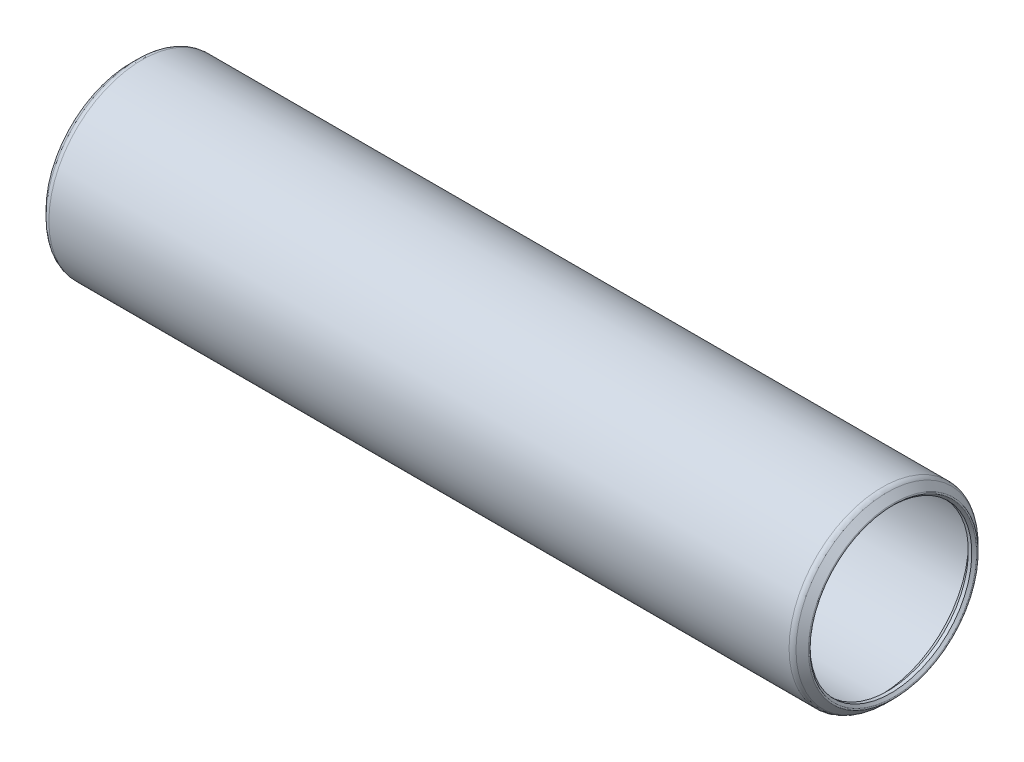
ISO-10303-21;
HEADER;
FILE_DESCRIPTION(('STEP AP214'),'2;1');
FILE_NAME('part.step','',(''),(''),'','','');
FILE_SCHEMA(('AUTOMOTIVE_DESIGN { 1 0 10303 214 1 1 1 1 }'));
ENDSEC;
DATA;
#1=APPLICATION_CONTEXT('core data for automotive mechanical design processes');
#2=APPLICATION_PROTOCOL_DEFINITION('international standard','automotive_design',2000,#1);
#3=PRODUCT_CONTEXT('',#1,'mechanical');
#4=PRODUCT('Part','Part','',(#3));
#5=PRODUCT_RELATED_PRODUCT_CATEGORY('part','',(#4));
#6=PRODUCT_DEFINITION_FORMATION('','',#4);
#7=PRODUCT_DEFINITION_CONTEXT('part definition',#1,'design');
#8=PRODUCT_DEFINITION('design','',#6,#7);
#9=PRODUCT_DEFINITION_SHAPE('','',#8);
#10=(LENGTH_UNIT() NAMED_UNIT(*) SI_UNIT(.MILLI.,.METRE.));
#11=(NAMED_UNIT(*) PLANE_ANGLE_UNIT() SI_UNIT($,.RADIAN.));
#12=(NAMED_UNIT(*) SI_UNIT($,.STERADIAN.) SOLID_ANGLE_UNIT());
#13=UNCERTAINTY_MEASURE_WITH_UNIT(LENGTH_MEASURE(1.E-05),#10,'distance_accuracy_value','');
#14=(GEOMETRIC_REPRESENTATION_CONTEXT(3) GLOBAL_UNCERTAINTY_ASSIGNED_CONTEXT((#13)) GLOBAL_UNIT_ASSIGNED_CONTEXT((#10,
#11,#12)) REPRESENTATION_CONTEXT('',''));
#15=CARTESIAN_POINT('',(0.,0.,0.));
#16=DIRECTION('',(0.,0.,1.));
#17=DIRECTION('',(1.,0.,0.));
#18=AXIS2_PLACEMENT_3D('',#15,#16,#17);
#19=CARTESIAN_POINT('',(-0.549710244842875,0.,0.));
#20=DIRECTION('',(-1.,0.,0.));
#21=DIRECTION('',(0.,0.,1.));
#22=AXIS2_PLACEMENT_3D('',#19,#20,#21);
#23=TOROIDAL_SURFACE('',#22,9.25736536726415,0.126999999999895);
#24=CARTESIAN_POINT('',(-0.639512806053455,0.,0.));
#25=DIRECTION('',(-1.,0.,0.));
#26=DIRECTION('',(0.,0.,1.));
#27=AXIS2_PLACEMENT_3D('',#24,#25,#26);
#28=CIRCLE('',#27,9.1675628060535);
#29=CARTESIAN_POINT('',(-0.639512806053455,0.,9.1675628060535));
#30=VERTEX_POINT('',#29);
#31=EDGE_CURVE('E10',#30,#30,#28,.T.);
#32=ORIENTED_EDGE('',*,*,#31,.F.);
#33=EDGE_LOOP('',(#32));
#34=FACE_BOUND('',#33,.T.);
#35=CARTESIAN_POINT('',(-0.639512806053455,0.,0.));
#36=DIRECTION('',(-1.,0.,0.));
#37=DIRECTION('',(0.,0.,1.));
#38=AXIS2_PLACEMENT_3D('',#35,#36,#37);
#39=CIRCLE('',#38,9.3471679284748);
#40=CARTESIAN_POINT('',(-0.639512806053455,0.,9.3471679284748));
#41=VERTEX_POINT('',#40);
#42=EDGE_CURVE('E78',#41,#41,#39,.T.);
#43=ORIENTED_EDGE('',*,*,#42,.T.);
#44=EDGE_LOOP('',(#43));
#45=FACE_BOUND('',#44,.T.);
#46=ADVANCED_FACE('F32',(#34,#45),#23,.T.);
#47=CARTESIAN_POINT('',(-0.639512806053455,0.,0.));
#48=DIRECTION('',(-1.,0.,0.));
#49=DIRECTION('',(0.,0.,1.));
#50=AXIS2_PLACEMENT_3D('',#47,#48,#49);
#51=CONICAL_SURFACE('',#50,9.1675628060535,0.785398163397549);
#52=CARTESIAN_POINT('',(-0.381000000000006,0.,0.));
#53=DIRECTION('',(-1.,0.,0.));
#54=DIRECTION('',(0.,0.,1.));
#55=AXIS2_PLACEMENT_3D('',#52,#53,#54);
#56=CIRCLE('',#55,8.90905);
#57=CARTESIAN_POINT('',(-0.381000000000006,0.,8.90905));
#58=VERTEX_POINT('',#57);
#59=EDGE_CURVE('E38',#58,#58,#56,.T.);
#60=ORIENTED_EDGE('',*,*,#59,.F.);
#61=EDGE_LOOP('',(#60));
#62=FACE_BOUND('',#61,.T.);
#63=ORIENTED_EDGE('',*,*,#31,.T.);
#64=EDGE_LOOP('',(#63));
#65=FACE_BOUND('',#64,.T.);
#66=ADVANCED_FACE('F151',(#62,#65),#51,.F.);
#67=CARTESIAN_POINT('',(82.6897,0.,0.));
#68=DIRECTION('',(-1.,0.,0.));
#69=DIRECTION('',(0.,0.,1.));
#70=AXIS2_PLACEMENT_3D('',#67,#68,#69);
#71=CYLINDRICAL_SURFACE('',#70,8.90905);
#72=CARTESIAN_POINT('',(0.,0.,0.));
#73=DIRECTION('',(-1.,0.,0.));
#74=DIRECTION('',(0.,0.,1.));
#75=AXIS2_PLACEMENT_3D('',#72,#73,#74);
#76=CIRCLE('',#75,8.90905);
#77=CARTESIAN_POINT('',(0.,0.,8.90905));
#78=VERTEX_POINT('',#77);
#79=EDGE_CURVE('E42',#78,#78,#76,.T.);
#80=ORIENTED_EDGE('',*,*,#79,.F.);
#81=EDGE_LOOP('',(#80));
#82=FACE_BOUND('',#81,.T.);
#83=ORIENTED_EDGE('',*,*,#59,.T.);
#84=EDGE_LOOP('',(#83));
#85=FACE_BOUND('',#84,.T.);
#86=ADVANCED_FACE('F146',(#82,#85),#71,.F.);
#87=CARTESIAN_POINT('',(0.,0.,0.));
#88=DIRECTION('',(1.,0.,0.));
#89=DIRECTION('',(0.,0.,-1.));
#90=AXIS2_PLACEMENT_3D('',#87,#88,#89);
#91=CONICAL_SURFACE('',#90,8.90905,0.785398163397448);
#92=CARTESIAN_POINT('',(0.761999999999999,0.,0.));
#93=DIRECTION('',(-1.,0.,0.));
#94=DIRECTION('',(0.,0.,1.));
#95=AXIS2_PLACEMENT_3D('',#92,#93,#94);
#96=CIRCLE('',#95,9.67105);
#97=CARTESIAN_POINT('',(0.761999999999999,0.,9.67105));
#98=VERTEX_POINT('',#97);
#99=EDGE_CURVE('E46',#98,#98,#96,.T.);
#100=ORIENTED_EDGE('',*,*,#99,.F.);
#101=EDGE_LOOP('',(#100));
#102=FACE_BOUND('',#101,.T.);
#103=ORIENTED_EDGE('',*,*,#79,.T.);
#104=EDGE_LOOP('',(#103));
#105=FACE_BOUND('',#104,.T.);
#106=ADVANCED_FACE('F140',(#102,#105),#91,.F.);
#107=CARTESIAN_POINT('',(82.6897,0.,0.));
#108=DIRECTION('',(-1.,0.,0.));
#109=DIRECTION('',(0.,0.,1.));
#110=AXIS2_PLACEMENT_3D('',#107,#108,#109);
#111=CYLINDRICAL_SURFACE('',#110,9.67105);
#112=CARTESIAN_POINT('',(81.9277,0.,0.));
#113=DIRECTION('',(-1.,0.,0.));
#114=DIRECTION('',(0.,0.,1.));
#115=AXIS2_PLACEMENT_3D('',#112,#113,#114);
#116=CIRCLE('',#115,9.67105);
#117=CARTESIAN_POINT('',(81.9277,0.,9.67105));
#118=VERTEX_POINT('',#117);
#119=EDGE_CURVE('E51',#118,#118,#116,.T.);
#120=ORIENTED_EDGE('',*,*,#119,.F.);
#121=EDGE_LOOP('',(#120));
#122=FACE_BOUND('',#121,.T.);
#123=ORIENTED_EDGE('',*,*,#99,.T.);
#124=EDGE_LOOP('',(#123));
#125=FACE_BOUND('',#124,.T.);
#126=ADVANCED_FACE('F134',(#122,#125),#111,.F.);
#127=CARTESIAN_POINT('',(81.9277,0.,0.));
#128=DIRECTION('',(-1.,0.,0.));
#129=DIRECTION('',(0.,0.,1.));
#130=AXIS2_PLACEMENT_3D('',#127,#128,#129);
#131=CONICAL_SURFACE('',#130,9.67105,0.785398163397448);
#132=CARTESIAN_POINT('',(82.6897,0.,0.));
#133=DIRECTION('',(-1.,0.,0.));
#134=DIRECTION('',(0.,0.,1.));
#135=AXIS2_PLACEMENT_3D('',#132,#133,#134);
#136=CIRCLE('',#135,8.90905);
#137=CARTESIAN_POINT('',(82.6897,0.,8.90905));
#138=VERTEX_POINT('',#137);
#139=EDGE_CURVE('E54',#138,#138,#136,.T.);
#140=ORIENTED_EDGE('',*,*,#139,.F.);
#141=EDGE_LOOP('',(#140));
#142=FACE_BOUND('',#141,.T.);
#143=ORIENTED_EDGE('',*,*,#119,.T.);
#144=EDGE_LOOP('',(#143));
#145=FACE_BOUND('',#144,.T.);
#146=ADVANCED_FACE('F128',(#142,#145),#131,.F.);
#147=CARTESIAN_POINT('',(82.6897,0.,0.));
#148=DIRECTION('',(-1.,0.,0.));
#149=DIRECTION('',(0.,0.,1.));
#150=AXIS2_PLACEMENT_3D('',#147,#148,#149);
#151=CYLINDRICAL_SURFACE('',#150,8.90905);
#152=CARTESIAN_POINT('',(83.0707,0.,0.));
#153=DIRECTION('',(-1.,0.,0.));
#154=DIRECTION('',(0.,0.,1.));
#155=AXIS2_PLACEMENT_3D('',#152,#153,#154);
#156=CIRCLE('',#155,8.90905);
#157=CARTESIAN_POINT('',(83.0707,0.,8.90905));
#158=VERTEX_POINT('',#157);
#159=EDGE_CURVE('E57',#158,#158,#156,.T.);
#160=ORIENTED_EDGE('',*,*,#159,.F.);
#161=EDGE_LOOP('',(#160));
#162=FACE_BOUND('',#161,.T.);
#163=ORIENTED_EDGE('',*,*,#139,.T.);
#164=EDGE_LOOP('',(#163));
#165=FACE_BOUND('',#164,.T.);
#166=ADVANCED_FACE('F122',(#162,#165),#151,.F.);
#167=CARTESIAN_POINT('',(83.0707,0.,0.));
#168=DIRECTION('',(1.,0.,0.));
#169=DIRECTION('',(0.,0.,-1.));
#170=AXIS2_PLACEMENT_3D('',#167,#168,#169);
#171=CONICAL_SURFACE('',#170,8.90905,0.785398163397687);
#172=CARTESIAN_POINT('',(83.3292128060545,0.,0.));
#173=DIRECTION('',(-1.,0.,0.));
#174=DIRECTION('',(0.,0.,1.));
#175=AXIS2_PLACEMENT_3D('',#172,#173,#174);
#176=CIRCLE('',#175,9.16756280605465);
#177=CARTESIAN_POINT('',(83.3292128060545,0.,9.16756280605465));
#178=VERTEX_POINT('',#177);
#179=EDGE_CURVE('E60',#178,#178,#176,.T.);
#180=ORIENTED_EDGE('',*,*,#179,.F.);
#181=EDGE_LOOP('',(#180));
#182=FACE_BOUND('',#181,.T.);
#183=ORIENTED_EDGE('',*,*,#159,.T.);
#184=EDGE_LOOP('',(#183));
#185=FACE_BOUND('',#184,.T.);
#186=ADVANCED_FACE('F116',(#182,#185),#171,.F.);
#187=CARTESIAN_POINT('',(83.2394102448447,0.,0.));
#188=DIRECTION('',(-1.,0.,0.));
#189=DIRECTION('',(0.,0.,1.));
#190=AXIS2_PLACEMENT_3D('',#187,#188,#189);
#191=TOROIDAL_SURFACE('',#190,9.25736536726415,0.126999999998507);
#192=CARTESIAN_POINT('',(83.3292128060546,0.,0.));
#193=DIRECTION('',(-1.,0.,0.));
#194=DIRECTION('',(0.,0.,1.));
#195=AXIS2_PLACEMENT_3D('',#192,#193,#194);
#196=CIRCLE('',#195,9.34716792847349);
#197=CARTESIAN_POINT('',(83.3292128060546,0.,9.34716792847349));
#198=VERTEX_POINT('',#197);
#199=EDGE_CURVE('E63',#198,#198,#196,.T.);
#200=ORIENTED_EDGE('',*,*,#199,.F.);
#201=EDGE_LOOP('',(#200));
#202=FACE_BOUND('',#201,.T.);
#203=ORIENTED_EDGE('',*,*,#179,.T.);
#204=EDGE_LOOP('',(#203));
#205=FACE_BOUND('',#204,.T.);
#206=ADVANCED_FACE('F110',(#202,#205),#191,.T.);
#207=CARTESIAN_POINT('',(83.3292128060546,0.,0.));
#208=DIRECTION('',(-1.,0.,0.));
#209=DIRECTION('',(0.,0.,1.));
#210=AXIS2_PLACEMENT_3D('',#207,#208,#209);
#211=CONICAL_SURFACE('',#210,9.34716792847349,0.785398163397463);
#212=CARTESIAN_POINT('',(82.6443153672624,0.,0.));
#213=DIRECTION('',(-1.,0.,0.));
#214=DIRECTION('',(0.,0.,1.));
#215=AXIS2_PLACEMENT_3D('',#212,#213,#214);
#216=CIRCLE('',#215,10.0320653672657);
#217=CARTESIAN_POINT('',(82.6443153672624,0.,10.0320653672657));
#218=VERTEX_POINT('',#217);
#219=EDGE_CURVE('E66',#218,#218,#216,.T.);
#220=ORIENTED_EDGE('',*,*,#219,.F.);
#221=EDGE_LOOP('',(#220));
#222=FACE_BOUND('',#221,.T.);
#223=ORIENTED_EDGE('',*,*,#199,.T.);
#224=EDGE_LOOP('',(#223));
#225=FACE_BOUND('',#224,.T.);
#226=ADVANCED_FACE('F104',(#222,#225),#211,.T.);
#227=CARTESIAN_POINT('',(82.1055000000017,0.,0.));
#228=DIRECTION('',(-1.,0.,0.));
#229=DIRECTION('',(0.,0.,1.));
#230=AXIS2_PLACEMENT_3D('',#227,#228,#229);
#231=TOROIDAL_SURFACE('',#230,9.49325000000493,0.76199999999513);
#232=CARTESIAN_POINT('',(82.1055000000017,0.,0.));
#233=DIRECTION('',(-1.,0.,0.));
#234=DIRECTION('',(0.,0.,1.));
#235=AXIS2_PLACEMENT_3D('',#232,#233,#234);
#236=CIRCLE('',#235,10.2552500000001);
#237=CARTESIAN_POINT('',(82.1055000000017,0.,10.2552500000001));
#238=VERTEX_POINT('',#237);
#239=EDGE_CURVE('E69',#238,#238,#236,.T.);
#240=ORIENTED_EDGE('',*,*,#239,.F.);
#241=EDGE_LOOP('',(#240));
#242=FACE_BOUND('',#241,.T.);
#243=ORIENTED_EDGE('',*,*,#219,.T.);
#244=EDGE_LOOP('',(#243));
#245=FACE_BOUND('',#244,.T.);
#246=ADVANCED_FACE('F98',(#242,#245),#231,.T.);
#247=CARTESIAN_POINT('',(82.6897,0.,0.));
#248=DIRECTION('',(-1.,0.,0.));
#249=DIRECTION('',(0.,0.,1.));
#250=AXIS2_PLACEMENT_3D('',#247,#248,#249);
#251=CYLINDRICAL_SURFACE('',#250,10.2552500000001);
#252=CARTESIAN_POINT('',(0.584199999997953,0.,0.));
#253=DIRECTION('',(-1.,0.,0.));
#254=DIRECTION('',(0.,0.,1.));
#255=AXIS2_PLACEMENT_3D('',#252,#253,#254);
#256=CIRCLE('',#255,10.2552500000001);
#257=CARTESIAN_POINT('',(0.584199999997953,0.,10.2552500000001));
#258=VERTEX_POINT('',#257);
#259=EDGE_CURVE('E72',#258,#258,#256,.T.);
#260=ORIENTED_EDGE('',*,*,#259,.F.);
#261=EDGE_LOOP('',(#260));
#262=FACE_BOUND('',#261,.T.);
#263=ORIENTED_EDGE('',*,*,#239,.T.);
#264=EDGE_LOOP('',(#263));
#265=FACE_BOUND('',#264,.T.);
#266=ADVANCED_FACE('F92',(#262,#265),#251,.T.);
#267=CARTESIAN_POINT('',(0.584199999998007,0.,0.));
#268=DIRECTION('',(-1.,0.,0.));
#269=DIRECTION('',(0.,0.,1.));
#270=AXIS2_PLACEMENT_3D('',#267,#268,#269);
#271=TOROIDAL_SURFACE('',#270,9.49325000000518,0.761999999994893);
#272=CARTESIAN_POINT('',(0.0453846327374552,0.,0.));
#273=DIRECTION('',(-1.,0.,0.));
#274=DIRECTION('',(0.,0.,1.));
#275=AXIS2_PLACEMENT_3D('',#272,#273,#274);
#276=CIRCLE('',#275,10.0320653672657);
#277=CARTESIAN_POINT('',(0.0453846327374552,0.,10.0320653672657));
#278=VERTEX_POINT('',#277);
#279=EDGE_CURVE('E75',#278,#278,#276,.T.);
#280=ORIENTED_EDGE('',*,*,#279,.F.);
#281=EDGE_LOOP('',(#280));
#282=FACE_BOUND('',#281,.T.);
#283=ORIENTED_EDGE('',*,*,#259,.T.);
#284=EDGE_LOOP('',(#283));
#285=FACE_BOUND('',#284,.T.);
#286=ADVANCED_FACE('F86',(#282,#285),#271,.T.);
#287=CARTESIAN_POINT('',(0.0453846327374552,0.,0.));
#288=DIRECTION('',(1.,0.,0.));
#289=DIRECTION('',(0.,0.,-1.));
#290=AXIS2_PLACEMENT_3D('',#287,#288,#289);
#291=CONICAL_SURFACE('',#290,10.0320653672657,0.785398163397456);
#292=ORIENTED_EDGE('',*,*,#42,.F.);
#293=EDGE_LOOP('',(#292));
#294=FACE_BOUND('',#293,.T.);
#295=ORIENTED_EDGE('',*,*,#279,.T.);
#296=EDGE_LOOP('',(#295));
#297=FACE_BOUND('',#296,.T.);
#298=ADVANCED_FACE('F83',(#294,#297),#291,.T.);
#299=CLOSED_SHELL('',(#46,#66,#86,#106,#126,#146,#166,#186,#206,#226,#246,#266,#286,#298));
#300=MANIFOLD_SOLID_BREP('B2',#299);
#301=ADVANCED_BREP_SHAPE_REPRESENTATION('',(#18,#300),#14);
#302=SHAPE_DEFINITION_REPRESENTATION(#9,#301);
ENDSEC;
END-ISO-10303-21;
